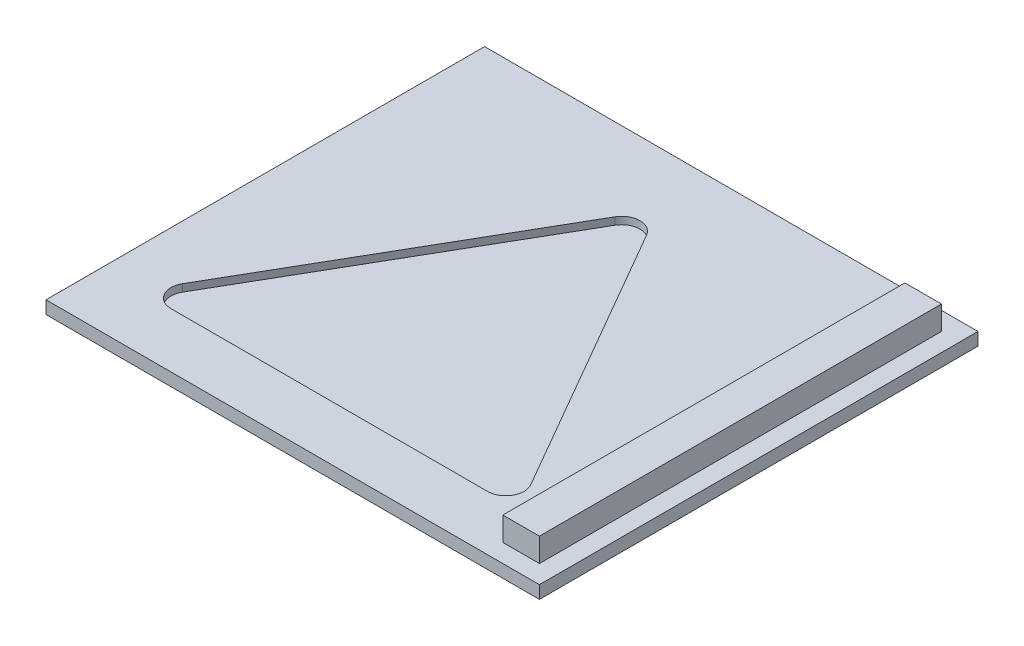
ISO-10303-21;
HEADER;
FILE_DESCRIPTION(('STEP AP214'),'2;1');
FILE_NAME('part.step','',(''),(''),'','','');
FILE_SCHEMA(('AUTOMOTIVE_DESIGN { 1 0 10303 214 1 1 1 1 }'));
ENDSEC;
DATA;
#1=APPLICATION_CONTEXT('core data for automotive mechanical design processes');
#2=APPLICATION_PROTOCOL_DEFINITION('international standard','automotive_design',2000,#1);
#3=PRODUCT_CONTEXT('',#1,'mechanical');
#4=PRODUCT('Part','Part','',(#3));
#5=PRODUCT_RELATED_PRODUCT_CATEGORY('part','',(#4));
#6=PRODUCT_DEFINITION_FORMATION('','',#4);
#7=PRODUCT_DEFINITION_CONTEXT('part definition',#1,'design');
#8=PRODUCT_DEFINITION('design','',#6,#7);
#9=PRODUCT_DEFINITION_SHAPE('','',#8);
#10=(LENGTH_UNIT() NAMED_UNIT(*) SI_UNIT(.MILLI.,.METRE.));
#11=(NAMED_UNIT(*) PLANE_ANGLE_UNIT() SI_UNIT($,.RADIAN.));
#12=(NAMED_UNIT(*) SI_UNIT($,.STERADIAN.) SOLID_ANGLE_UNIT());
#13=UNCERTAINTY_MEASURE_WITH_UNIT(LENGTH_MEASURE(1.E-05),#10,'distance_accuracy_value','');
#14=(GEOMETRIC_REPRESENTATION_CONTEXT(3) GLOBAL_UNCERTAINTY_ASSIGNED_CONTEXT((#13)) GLOBAL_UNIT_ASSIGNED_CONTEXT((#10,
#11,#12)) REPRESENTATION_CONTEXT('',''));
#15=CARTESIAN_POINT('',(0.,0.,0.));
#16=DIRECTION('',(0.,0.,1.));
#17=DIRECTION('',(1.,0.,0.));
#18=AXIS2_PLACEMENT_3D('',#15,#16,#17);
#19=CARTESIAN_POINT('',(0.,0.7,0.));
#20=DIRECTION('',(0.,1.,0.));
#21=DIRECTION('',(0.,0.,1.));
#22=AXIS2_PLACEMENT_3D('',#19,#20,#21);
#23=PLANE('',#22);
#24=CARTESIAN_POINT('',(7.16025403784438,0.7,8.));
#25=DIRECTION('',(0.,1.,0.));
#26=DIRECTION('',(0.,0.,-1.));
#27=AXIS2_PLACEMENT_3D('',#24,#25,#26);
#28=CIRCLE('',#27,1.);
#29=CARTESIAN_POINT('',(7.16025403784437,0.7,9.));
#30=VERTEX_POINT('',#29);
#31=CARTESIAN_POINT('',(8.02627944162881,0.7,7.5));
#32=VERTEX_POINT('',#31);
#33=EDGE_CURVE('E58',#30,#32,#28,.T.);
#34=ORIENTED_EDGE('',*,*,#33,.F.);
#35=DIRECTION('',(1.,0.,0.));
#36=VECTOR('',#35,1.);
#37=CARTESIAN_POINT('',(-10.1602540378444,0.7,9.));
#38=LINE('',#37,#36);
#39=CARTESIAN_POINT('',(-10.1602540378444,0.7,9.));
#40=VERTEX_POINT('',#39);
#41=EDGE_CURVE('E178',#40,#30,#38,.T.);
#42=ORIENTED_EDGE('',*,*,#41,.F.);
#43=CARTESIAN_POINT('',(-10.1602540378444,0.7,8.));
#44=DIRECTION('',(0.,1.,0.));
#45=DIRECTION('',(0.,0.,-1.));
#46=AXIS2_PLACEMENT_3D('',#43,#44,#45);
#47=CIRCLE('',#46,1.);
#48=CARTESIAN_POINT('',(-11.0262794416288,0.7,7.5));
#49=VERTEX_POINT('',#48);
#50=EDGE_CURVE('E204',#49,#40,#47,.T.);
#51=ORIENTED_EDGE('',*,*,#50,.F.);
#52=DIRECTION('',(-0.5,0.,0.866025403784439));
#53=VECTOR('',#52,1.);
#54=CARTESIAN_POINT('',(-2.36602540378445,0.7,-7.5));
#55=LINE('',#54,#53);
#56=CARTESIAN_POINT('',(-2.36602540378445,0.7,-7.5));
#57=VERTEX_POINT('',#56);
#58=EDGE_CURVE('E201',#57,#49,#55,.T.);
#59=ORIENTED_EDGE('',*,*,#58,.F.);
#60=CARTESIAN_POINT('',(-1.50000000000001,0.7,-7.));
#61=DIRECTION('',(0.,1.,0.));
#62=DIRECTION('',(0.,0.,1.));
#63=AXIS2_PLACEMENT_3D('',#60,#61,#62);
#64=CIRCLE('',#63,1.);
#65=CARTESIAN_POINT('',(-0.633974596215569,0.7,-7.5));
#66=VERTEX_POINT('',#65);
#67=EDGE_CURVE('E198',#66,#57,#64,.T.);
#68=ORIENTED_EDGE('',*,*,#67,.F.);
#69=DIRECTION('',(-0.5,0.,-0.866025403784439));
#70=VECTOR('',#69,1.);
#71=CARTESIAN_POINT('',(8.02627944162882,0.7,7.5));
#72=LINE('',#71,#70);
#73=EDGE_CURVE('E195',#32,#66,#72,.T.);
#74=ORIENTED_EDGE('',*,*,#73,.F.);
#75=EDGE_LOOP('',(#34,#42,#51,#59,#68,#74));
#76=FACE_BOUND('',#75,.T.);
#77=DIRECTION('',(-1.,0.,0.));
#78=VECTOR('',#77,1.);
#79=CARTESIAN_POINT('',(13.,0.7,-12.));
#80=LINE('',#79,#78);
#81=CARTESIAN_POINT('',(13.,0.7,-12.));
#82=VERTEX_POINT('',#81);
#83=CARTESIAN_POINT('',(-14.,0.7,-12.));
#84=VERTEX_POINT('',#83);
#85=EDGE_CURVE('E145',#82,#84,#80,.T.);
#86=ORIENTED_EDGE('',*,*,#85,.T.);
#87=DIRECTION('',(0.,0.,1.));
#88=VECTOR('',#87,1.);
#89=CARTESIAN_POINT('',(-14.,0.7,-12.));
#90=LINE('',#89,#88);
#91=CARTESIAN_POINT('',(-14.,0.7,12.));
#92=VERTEX_POINT('',#91);
#93=EDGE_CURVE('E149',#84,#92,#90,.T.);
#94=ORIENTED_EDGE('',*,*,#93,.T.);
#95=DIRECTION('',(1.,0.,0.));
#96=VECTOR('',#95,1.);
#97=CARTESIAN_POINT('',(13.,0.7,12.));
#98=LINE('',#97,#96);
#99=CARTESIAN_POINT('',(13.,0.7,12.));
#100=VERTEX_POINT('',#99);
#101=EDGE_CURVE('E248',#92,#100,#98,.T.);
#102=ORIENTED_EDGE('',*,*,#101,.T.);
#103=DIRECTION('',(0.,0.,-1.));
#104=VECTOR('',#103,1.);
#105=CARTESIAN_POINT('',(13.,0.7,12.));
#106=LINE('',#105,#104);
#107=EDGE_CURVE('E151',#100,#82,#106,.T.);
#108=ORIENTED_EDGE('',*,*,#107,.T.);
#109=EDGE_LOOP('',(#86,#94,#102,#108));
#110=FACE_BOUND('',#109,.T.);
#111=DIRECTION('',(1.,0.,0.));
#112=VECTOR('',#111,1.);
#113=CARTESIAN_POINT('',(12.,0.7,11.0000000000001));
#114=LINE('',#113,#112);
#115=CARTESIAN_POINT('',(9.99999999999999,0.7,11.0000000000001));
#116=VERTEX_POINT('',#115);
#117=CARTESIAN_POINT('',(12.,0.7,11.0000000000001));
#118=VERTEX_POINT('',#117);
#119=EDGE_CURVE('E234',#116,#118,#114,.T.);
#120=ORIENTED_EDGE('',*,*,#119,.F.);
#121=DIRECTION('',(0.,0.,1.));
#122=VECTOR('',#121,1.);
#123=CARTESIAN_POINT('',(9.99999999999999,0.7,11.0000000000001));
#124=LINE('',#123,#122);
#125=CARTESIAN_POINT('',(9.99999999999999,0.7,-11.));
#126=VERTEX_POINT('',#125);
#127=EDGE_CURVE('E211',#126,#116,#124,.T.);
#128=ORIENTED_EDGE('',*,*,#127,.F.);
#129=DIRECTION('',(-1.,0.,0.));
#130=VECTOR('',#129,1.);
#131=CARTESIAN_POINT('',(12.,0.7,-11.));
#132=LINE('',#131,#130);
#133=CARTESIAN_POINT('',(12.,0.7,-11.));
#134=VERTEX_POINT('',#133);
#135=EDGE_CURVE('E225',#134,#126,#132,.T.);
#136=ORIENTED_EDGE('',*,*,#135,.F.);
#137=DIRECTION('',(0.,0.,-1.));
#138=VECTOR('',#137,1.);
#139=CARTESIAN_POINT('',(12.,0.7,11.0000000000001));
#140=LINE('',#139,#138);
#141=EDGE_CURVE('E236',#118,#134,#140,.T.);
#142=ORIENTED_EDGE('',*,*,#141,.F.);
#143=EDGE_LOOP('',(#120,#128,#136,#142));
#144=FACE_BOUND('',#143,.T.);
#145=ADVANCED_FACE('F43',(#76,#110,#144),#23,.T.);
#146=CARTESIAN_POINT('',(13.,0.7,12.));
#147=DIRECTION('',(0.,0.,-1.));
#148=DIRECTION('',(-1.,0.,0.));
#149=AXIS2_PLACEMENT_3D('',#146,#147,#148);
#150=PLANE('',#149);
#151=DIRECTION('',(1.,0.,0.));
#152=VECTOR('',#151,1.);
#153=CARTESIAN_POINT('',(13.,0.,12.));
#154=LINE('',#153,#152);
#155=CARTESIAN_POINT('',(-14.,0.,12.));
#156=VERTEX_POINT('',#155);
#157=CARTESIAN_POINT('',(13.,0.,12.));
#158=VERTEX_POINT('',#157);
#159=EDGE_CURVE('E247',#156,#158,#154,.T.);
#160=ORIENTED_EDGE('',*,*,#159,.T.);
#161=DIRECTION('',(0.,-1.,0.));
#162=VECTOR('',#161,1.);
#163=CARTESIAN_POINT('',(13.,0.7,12.));
#164=LINE('',#163,#162);
#165=EDGE_CURVE('E11',#100,#158,#164,.T.);
#166=ORIENTED_EDGE('',*,*,#165,.F.);
#167=ORIENTED_EDGE('',*,*,#101,.F.);
#168=DIRECTION('',(0.,1.,0.));
#169=VECTOR('',#168,1.);
#170=CARTESIAN_POINT('',(-14.,-24.0208242989286,12.));
#171=LINE('',#170,#169);
#172=EDGE_CURVE('E164',#156,#92,#171,.T.);
#173=ORIENTED_EDGE('',*,*,#172,.F.);
#174=EDGE_LOOP('',(#160,#166,#167,#173));
#175=FACE_BOUND('',#174,.T.);
#176=ADVANCED_FACE('F45',(#175),#150,.F.);
#177=CARTESIAN_POINT('',(13.,0.7,12.));
#178=DIRECTION('',(-1.,0.,0.));
#179=DIRECTION('',(0.,0.,1.));
#180=AXIS2_PLACEMENT_3D('',#177,#178,#179);
#181=PLANE('',#180);
#182=DIRECTION('',(0.,0.,-1.));
#183=VECTOR('',#182,1.);
#184=CARTESIAN_POINT('',(13.,0.,12.));
#185=LINE('',#184,#183);
#186=CARTESIAN_POINT('',(13.,0.,-12.));
#187=VERTEX_POINT('',#186);
#188=EDGE_CURVE('E252',#158,#187,#185,.T.);
#189=ORIENTED_EDGE('',*,*,#188,.T.);
#190=DIRECTION('',(0.,-1.,0.));
#191=VECTOR('',#190,1.);
#192=CARTESIAN_POINT('',(13.,0.7,-12.));
#193=LINE('',#192,#191);
#194=EDGE_CURVE('E51',#82,#187,#193,.T.);
#195=ORIENTED_EDGE('',*,*,#194,.F.);
#196=ORIENTED_EDGE('',*,*,#107,.F.);
#197=ORIENTED_EDGE('',*,*,#165,.T.);
#198=EDGE_LOOP('',(#189,#195,#196,#197));
#199=FACE_BOUND('',#198,.T.);
#200=ADVANCED_FACE('F260',(#199),#181,.F.);
#201=CARTESIAN_POINT('',(13.,0.7,-12.));
#202=DIRECTION('',(0.,0.,1.));
#203=DIRECTION('',(1.,0.,0.));
#204=AXIS2_PLACEMENT_3D('',#201,#202,#203);
#205=PLANE('',#204);
#206=DIRECTION('',(-1.,0.,0.));
#207=VECTOR('',#206,1.);
#208=CARTESIAN_POINT('',(13.,0.,-12.));
#209=LINE('',#208,#207);
#210=CARTESIAN_POINT('',(-14.,0.,-12.));
#211=VERTEX_POINT('',#210);
#212=EDGE_CURVE('E160',#187,#211,#209,.T.);
#213=ORIENTED_EDGE('',*,*,#212,.T.);
#214=DIRECTION('',(0.,1.,0.));
#215=VECTOR('',#214,1.);
#216=CARTESIAN_POINT('',(-14.,-24.0208242989286,-12.));
#217=LINE('',#216,#215);
#218=EDGE_CURVE('E157',#211,#84,#217,.T.);
#219=ORIENTED_EDGE('',*,*,#218,.T.);
#220=ORIENTED_EDGE('',*,*,#85,.F.);
#221=ORIENTED_EDGE('',*,*,#194,.T.);
#222=EDGE_LOOP('',(#213,#219,#220,#221));
#223=FACE_BOUND('',#222,.T.);
#224=ADVANCED_FACE('F158',(#223),#205,.F.);
#225=CARTESIAN_POINT('',(0.,0.,0.));
#226=DIRECTION('',(0.,1.,0.));
#227=DIRECTION('',(0.,0.,1.));
#228=AXIS2_PLACEMENT_3D('',#225,#226,#227);
#229=PLANE('',#228);
#230=ORIENTED_EDGE('',*,*,#159,.F.);
#231=DIRECTION('',(0.,0.,-1.));
#232=VECTOR('',#231,1.);
#233=CARTESIAN_POINT('',(-14.,0.,-12.));
#234=LINE('',#233,#232);
#235=EDGE_CURVE('E172',#156,#211,#234,.T.);
#236=ORIENTED_EDGE('',*,*,#235,.T.);
#237=ORIENTED_EDGE('',*,*,#212,.F.);
#238=ORIENTED_EDGE('',*,*,#188,.F.);
#239=EDGE_LOOP('',(#230,#236,#237,#238));
#240=FACE_BOUND('',#239,.T.);
#241=ADVANCED_FACE('F257',(#240),#229,.F.);
#242=CARTESIAN_POINT('',(9.99999999999999,2.,11.0000000000001));
#243=DIRECTION('',(1.,0.,0.));
#244=DIRECTION('',(0.,0.,-1.));
#245=AXIS2_PLACEMENT_3D('',#242,#243,#244);
#246=PLANE('',#245);
#247=ORIENTED_EDGE('',*,*,#127,.T.);
#248=DIRECTION('',(0.,-1.,0.));
#249=VECTOR('',#248,1.);
#250=CARTESIAN_POINT('',(9.99999999999999,2.,11.0000000000001));
#251=LINE('',#250,#249);
#252=CARTESIAN_POINT('',(9.99999999999999,2.,11.0000000000001));
#253=VERTEX_POINT('',#252);
#254=EDGE_CURVE('E245',#253,#116,#251,.T.);
#255=ORIENTED_EDGE('',*,*,#254,.F.);
#256=DIRECTION('',(0.,0.,1.));
#257=VECTOR('',#256,1.);
#258=CARTESIAN_POINT('',(9.99999999999999,2.,11.0000000000001));
#259=LINE('',#258,#257);
#260=CARTESIAN_POINT('',(9.99999999999999,2.,-11.));
#261=VERTEX_POINT('',#260);
#262=EDGE_CURVE('E221',#261,#253,#259,.T.);
#263=ORIENTED_EDGE('',*,*,#262,.F.);
#264=DIRECTION('',(0.,-1.,0.));
#265=VECTOR('',#264,1.);
#266=CARTESIAN_POINT('',(9.99999999999999,2.,-11.));
#267=LINE('',#266,#265);
#268=EDGE_CURVE('E231',#261,#126,#267,.T.);
#269=ORIENTED_EDGE('',*,*,#268,.T.);
#270=EDGE_LOOP('',(#247,#255,#263,#269));
#271=FACE_BOUND('',#270,.T.);
#272=ADVANCED_FACE('F274',(#271),#246,.F.);
#273=CARTESIAN_POINT('',(12.,2.,11.0000000000001));
#274=DIRECTION('',(0.,0.,-1.));
#275=DIRECTION('',(-1.,0.,0.));
#276=AXIS2_PLACEMENT_3D('',#273,#274,#275);
#277=PLANE('',#276);
#278=ORIENTED_EDGE('',*,*,#119,.T.);
#279=DIRECTION('',(0.,-1.,0.));
#280=VECTOR('',#279,1.);
#281=CARTESIAN_POINT('',(12.,2.,11.0000000000001));
#282=LINE('',#281,#280);
#283=CARTESIAN_POINT('',(12.,2.,11.0000000000001));
#284=VERTEX_POINT('',#283);
#285=EDGE_CURVE('E242',#284,#118,#282,.T.);
#286=ORIENTED_EDGE('',*,*,#285,.F.);
#287=DIRECTION('',(1.,0.,0.));
#288=VECTOR('',#287,1.);
#289=CARTESIAN_POINT('',(12.,2.,11.0000000000001));
#290=LINE('',#289,#288);
#291=EDGE_CURVE('E224',#253,#284,#290,.T.);
#292=ORIENTED_EDGE('',*,*,#291,.F.);
#293=ORIENTED_EDGE('',*,*,#254,.T.);
#294=EDGE_LOOP('',(#278,#286,#292,#293));
#295=FACE_BOUND('',#294,.T.);
#296=ADVANCED_FACE('F280',(#295),#277,.F.);
#297=CARTESIAN_POINT('',(12.,2.,11.0000000000001));
#298=DIRECTION('',(-1.,0.,0.));
#299=DIRECTION('',(0.,0.,1.));
#300=AXIS2_PLACEMENT_3D('',#297,#298,#299);
#301=PLANE('',#300);
#302=ORIENTED_EDGE('',*,*,#141,.T.);
#303=DIRECTION('',(0.,-1.,0.));
#304=VECTOR('',#303,1.);
#305=CARTESIAN_POINT('',(12.,2.,-11.));
#306=LINE('',#305,#304);
#307=CARTESIAN_POINT('',(12.,2.,-11.));
#308=VERTEX_POINT('',#307);
#309=EDGE_CURVE('E66',#308,#134,#306,.T.);
#310=ORIENTED_EDGE('',*,*,#309,.F.);
#311=DIRECTION('',(0.,0.,-1.));
#312=VECTOR('',#311,1.);
#313=CARTESIAN_POINT('',(12.,2.,11.0000000000001));
#314=LINE('',#313,#312);
#315=EDGE_CURVE('E227',#284,#308,#314,.T.);
#316=ORIENTED_EDGE('',*,*,#315,.F.);
#317=ORIENTED_EDGE('',*,*,#285,.T.);
#318=EDGE_LOOP('',(#302,#310,#316,#317));
#319=FACE_BOUND('',#318,.T.);
#320=ADVANCED_FACE('F285',(#319),#301,.F.);
#321=CARTESIAN_POINT('',(12.,2.,-11.));
#322=DIRECTION('',(0.,0.,1.));
#323=DIRECTION('',(1.,0.,0.));
#324=AXIS2_PLACEMENT_3D('',#321,#322,#323);
#325=PLANE('',#324);
#326=ORIENTED_EDGE('',*,*,#135,.T.);
#327=ORIENTED_EDGE('',*,*,#268,.F.);
#328=DIRECTION('',(-1.,0.,0.));
#329=VECTOR('',#328,1.);
#330=CARTESIAN_POINT('',(12.,2.,-11.));
#331=LINE('',#330,#329);
#332=EDGE_CURVE('E229',#308,#261,#331,.T.);
#333=ORIENTED_EDGE('',*,*,#332,.F.);
#334=ORIENTED_EDGE('',*,*,#309,.T.);
#335=EDGE_LOOP('',(#326,#327,#333,#334));
#336=FACE_BOUND('',#335,.T.);
#337=ADVANCED_FACE('F299',(#336),#325,.F.);
#338=CARTESIAN_POINT('',(0.,2.,0.));
#339=DIRECTION('',(0.,1.,0.));
#340=DIRECTION('',(0.,0.,1.));
#341=AXIS2_PLACEMENT_3D('',#338,#339,#340);
#342=PLANE('',#341);
#343=ORIENTED_EDGE('',*,*,#262,.T.);
#344=ORIENTED_EDGE('',*,*,#291,.T.);
#345=ORIENTED_EDGE('',*,*,#315,.T.);
#346=ORIENTED_EDGE('',*,*,#332,.T.);
#347=EDGE_LOOP('',(#343,#344,#345,#346));
#348=FACE_BOUND('',#347,.T.);
#349=ADVANCED_FACE('F298',(#348),#342,.T.);
#350=CARTESIAN_POINT('',(7.16025403784438,0.3,8.));
#351=DIRECTION('',(0.,1.,0.));
#352=DIRECTION('',(0.,0.,1.));
#353=AXIS2_PLACEMENT_3D('',#350,#351,#352);
#354=CYLINDRICAL_SURFACE('',#353,1.);
#355=ORIENTED_EDGE('',*,*,#33,.T.);
#356=DIRECTION('',(0.,1.,0.));
#357=VECTOR('',#356,1.);
#358=CARTESIAN_POINT('',(8.02627944162882,0.3,7.5));
#359=LINE('',#358,#357);
#360=CARTESIAN_POINT('',(8.02627944162882,0.3,7.5));
#361=VERTEX_POINT('',#360);
#362=EDGE_CURVE('E193',#361,#32,#359,.T.);
#363=ORIENTED_EDGE('',*,*,#362,.F.);
#364=CARTESIAN_POINT('',(7.16025403784438,0.3,8.));
#365=DIRECTION('',(0.,1.,0.));
#366=DIRECTION('',(0.,0.,-1.));
#367=AXIS2_PLACEMENT_3D('',#364,#365,#366);
#368=CIRCLE('',#367,1.);
#369=CARTESIAN_POINT('',(7.16025403784437,0.3,9.));
#370=VERTEX_POINT('',#369);
#371=EDGE_CURVE('E174',#370,#361,#368,.T.);
#372=ORIENTED_EDGE('',*,*,#371,.F.);
#373=DIRECTION('',(0.,1.,0.));
#374=VECTOR('',#373,1.);
#375=CARTESIAN_POINT('',(7.16025403784437,0.3,9.));
#376=LINE('',#375,#374);
#377=EDGE_CURVE('E209',#370,#30,#376,.T.);
#378=ORIENTED_EDGE('',*,*,#377,.T.);
#379=EDGE_LOOP('',(#355,#363,#372,#378));
#380=FACE_BOUND('',#379,.T.);
#381=ADVANCED_FACE('F306',(#380),#354,.F.);
#382=CARTESIAN_POINT('',(-10.1602540378444,0.3,9.));
#383=DIRECTION('',(0.,0.,1.));
#384=DIRECTION('',(1.,0.,0.));
#385=AXIS2_PLACEMENT_3D('',#382,#383,#384);
#386=PLANE('',#385);
#387=ORIENTED_EDGE('',*,*,#41,.T.);
#388=ORIENTED_EDGE('',*,*,#377,.F.);
#389=DIRECTION('',(1.,0.,0.));
#390=VECTOR('',#389,1.);
#391=CARTESIAN_POINT('',(-10.1602540378444,0.3,9.));
#392=LINE('',#391,#390);
#393=CARTESIAN_POINT('',(-10.1602540378444,0.3,9.));
#394=VERTEX_POINT('',#393);
#395=EDGE_CURVE('E190',#394,#370,#392,.T.);
#396=ORIENTED_EDGE('',*,*,#395,.F.);
#397=DIRECTION('',(0.,1.,0.));
#398=VECTOR('',#397,1.);
#399=CARTESIAN_POINT('',(-10.1602540378444,0.3,9.));
#400=LINE('',#399,#398);
#401=EDGE_CURVE('E212',#394,#40,#400,.T.);
#402=ORIENTED_EDGE('',*,*,#401,.T.);
#403=EDGE_LOOP('',(#387,#388,#396,#402));
#404=FACE_BOUND('',#403,.T.);
#405=ADVANCED_FACE('F312',(#404),#386,.F.);
#406=CARTESIAN_POINT('',(-10.1602540378444,0.3,8.));
#407=DIRECTION('',(0.,1.,0.));
#408=DIRECTION('',(0.,0.,1.));
#409=AXIS2_PLACEMENT_3D('',#406,#407,#408);
#410=CYLINDRICAL_SURFACE('',#409,1.);
#411=ORIENTED_EDGE('',*,*,#50,.T.);
#412=ORIENTED_EDGE('',*,*,#401,.F.);
#413=CARTESIAN_POINT('',(-10.1602540378444,0.3,8.));
#414=DIRECTION('',(0.,1.,0.));
#415=DIRECTION('',(0.,0.,-1.));
#416=AXIS2_PLACEMENT_3D('',#413,#414,#415);
#417=CIRCLE('',#416,1.);
#418=CARTESIAN_POINT('',(-11.0262794416288,0.3,7.5));
#419=VERTEX_POINT('',#418);
#420=EDGE_CURVE('E187',#419,#394,#417,.T.);
#421=ORIENTED_EDGE('',*,*,#420,.F.);
#422=DIRECTION('',(0.,1.,0.));
#423=VECTOR('',#422,1.);
#424=CARTESIAN_POINT('',(-11.0262794416288,0.3,7.5));
#425=LINE('',#424,#423);
#426=EDGE_CURVE('E214',#419,#49,#425,.T.);
#427=ORIENTED_EDGE('',*,*,#426,.T.);
#428=EDGE_LOOP('',(#411,#412,#421,#427));
#429=FACE_BOUND('',#428,.T.);
#430=ADVANCED_FACE('F325',(#429),#410,.F.);
#431=CARTESIAN_POINT('',(-2.36602540378445,0.3,-7.5));
#432=DIRECTION('',(-0.866025403784439,0.,-0.5));
#433=DIRECTION('',(-0.5,0.,0.866025403784439));
#434=AXIS2_PLACEMENT_3D('',#431,#432,#433);
#435=PLANE('',#434);
#436=ORIENTED_EDGE('',*,*,#58,.T.);
#437=ORIENTED_EDGE('',*,*,#426,.F.);
#438=DIRECTION('',(-0.5,0.,0.866025403784439));
#439=VECTOR('',#438,1.);
#440=CARTESIAN_POINT('',(-2.36602540378445,0.3,-7.5));
#441=LINE('',#440,#439);
#442=CARTESIAN_POINT('',(-2.36602540378445,0.3,-7.5));
#443=VERTEX_POINT('',#442);
#444=EDGE_CURVE('E184',#443,#419,#441,.T.);
#445=ORIENTED_EDGE('',*,*,#444,.F.);
#446=DIRECTION('',(0.,1.,0.));
#447=VECTOR('',#446,1.);
#448=CARTESIAN_POINT('',(-2.36602540378445,0.3,-7.5));
#449=LINE('',#448,#447);
#450=EDGE_CURVE('E216',#443,#57,#449,.T.);
#451=ORIENTED_EDGE('',*,*,#450,.T.);
#452=EDGE_LOOP('',(#436,#437,#445,#451));
#453=FACE_BOUND('',#452,.T.);
#454=ADVANCED_FACE('F321',(#453),#435,.F.);
#455=CARTESIAN_POINT('',(-1.50000000000001,0.3,-7.));
#456=DIRECTION('',(0.,1.,0.));
#457=DIRECTION('',(0.,0.,1.));
#458=AXIS2_PLACEMENT_3D('',#455,#456,#457);
#459=CYLINDRICAL_SURFACE('',#458,1.);
#460=ORIENTED_EDGE('',*,*,#67,.T.);
#461=ORIENTED_EDGE('',*,*,#450,.F.);
#462=CARTESIAN_POINT('',(-1.50000000000001,0.3,-7.));
#463=DIRECTION('',(0.,1.,0.));
#464=DIRECTION('',(0.,0.,1.));
#465=AXIS2_PLACEMENT_3D('',#462,#463,#464);
#466=CIRCLE('',#465,1.);
#467=CARTESIAN_POINT('',(-0.633974596215569,0.3,-7.5));
#468=VERTEX_POINT('',#467);
#469=EDGE_CURVE('E181',#468,#443,#466,.T.);
#470=ORIENTED_EDGE('',*,*,#469,.F.);
#471=DIRECTION('',(0.,1.,0.));
#472=VECTOR('',#471,1.);
#473=CARTESIAN_POINT('',(-0.633974596215569,0.3,-7.5));
#474=LINE('',#473,#472);
#475=EDGE_CURVE('E218',#468,#66,#474,.T.);
#476=ORIENTED_EDGE('',*,*,#475,.T.);
#477=EDGE_LOOP('',(#460,#461,#470,#476));
#478=FACE_BOUND('',#477,.T.);
#479=ADVANCED_FACE('F317',(#478),#459,.F.);
#480=CARTESIAN_POINT('',(8.02627944162882,0.3,7.5));
#481=DIRECTION('',(0.866025403784439,0.,-0.5));
#482=DIRECTION('',(-0.5,0.,-0.866025403784439));
#483=AXIS2_PLACEMENT_3D('',#480,#481,#482);
#484=PLANE('',#483);
#485=ORIENTED_EDGE('',*,*,#73,.T.);
#486=ORIENTED_EDGE('',*,*,#475,.F.);
#487=DIRECTION('',(-0.5,0.,-0.866025403784439));
#488=VECTOR('',#487,1.);
#489=CARTESIAN_POINT('',(8.02627944162882,0.3,7.5));
#490=LINE('',#489,#488);
#491=EDGE_CURVE('E177',#361,#468,#490,.T.);
#492=ORIENTED_EDGE('',*,*,#491,.F.);
#493=ORIENTED_EDGE('',*,*,#362,.T.);
#494=EDGE_LOOP('',(#485,#486,#492,#493));
#495=FACE_BOUND('',#494,.T.);
#496=ADVANCED_FACE('F313',(#495),#484,.F.);
#497=CARTESIAN_POINT('',(7.16025403784438,0.3,8.));
#498=DIRECTION('',(0.,-1.,0.));
#499=DIRECTION('',(0.,0.,-1.));
#500=AXIS2_PLACEMENT_3D('',#497,#498,#499);
#501=PLANE('',#500);
#502=ORIENTED_EDGE('',*,*,#371,.T.);
#503=ORIENTED_EDGE('',*,*,#491,.T.);
#504=ORIENTED_EDGE('',*,*,#469,.T.);
#505=ORIENTED_EDGE('',*,*,#444,.T.);
#506=ORIENTED_EDGE('',*,*,#420,.T.);
#507=ORIENTED_EDGE('',*,*,#395,.T.);
#508=EDGE_LOOP('',(#502,#503,#504,#505,#506,#507));
#509=FACE_BOUND('',#508,.T.);
#510=ADVANCED_FACE('F316',(#509),#501,.F.);
#511=CARTESIAN_POINT('',(-14.,-24.0208242989286,-12.));
#512=DIRECTION('',(-1.,0.,0.));
#513=DIRECTION('',(0.,0.,1.));
#514=AXIS2_PLACEMENT_3D('',#511,#512,#513);
#515=PLANE('',#514);
#516=ORIENTED_EDGE('',*,*,#235,.F.);
#517=ORIENTED_EDGE('',*,*,#172,.T.);
#518=ORIENTED_EDGE('',*,*,#93,.F.);
#519=ORIENTED_EDGE('',*,*,#218,.F.);
#520=EDGE_LOOP('',(#516,#517,#518,#519));
#521=FACE_BOUND('',#520,.T.);
#522=ADVANCED_FACE('F167',(#521),#515,.T.);
#523=CLOSED_SHELL('',(#145,#176,#200,#224,#241,#272,#296,#320,#337,#349,#381,#405,#430,#454,
#479,#496,#510,#522));
#524=MANIFOLD_SOLID_BREP('B2',#523);
#525=ADVANCED_BREP_SHAPE_REPRESENTATION('',(#18,#524),#14);
#526=SHAPE_DEFINITION_REPRESENTATION(#9,#525);
ENDSEC;
END-ISO-10303-21;
